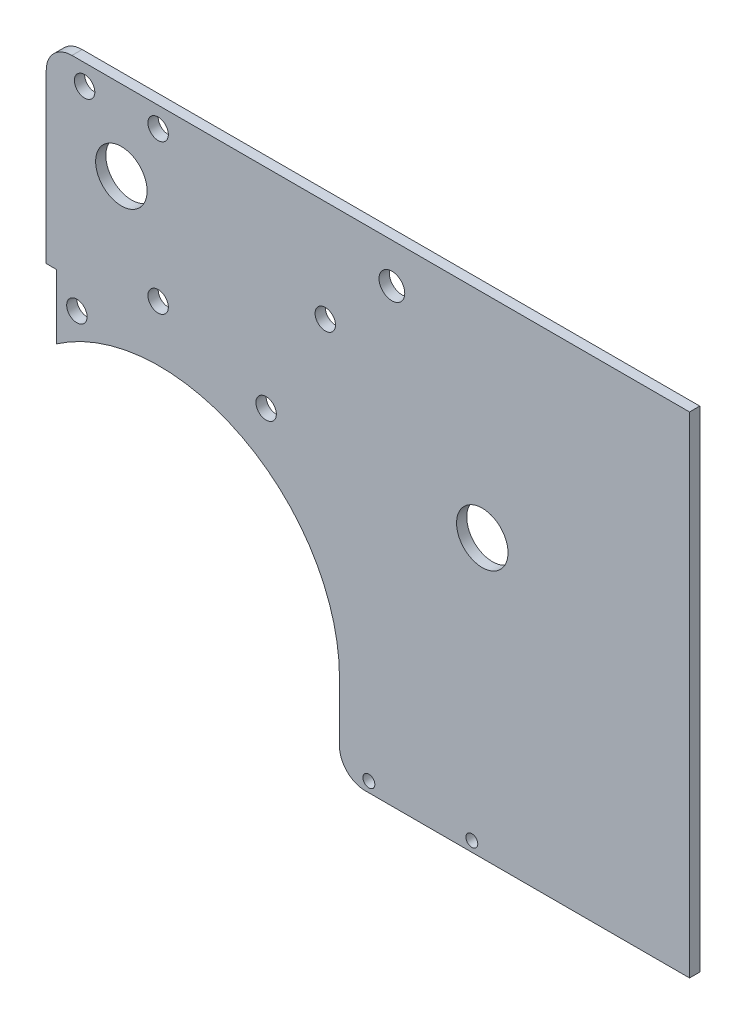
ISO-10303-21;
HEADER;
FILE_DESCRIPTION(('STEP AP214'),'2;1');
FILE_NAME('part.step','',(''),(''),'','','');
FILE_SCHEMA(('AUTOMOTIVE_DESIGN { 1 0 10303 214 1 1 1 1 }'));
ENDSEC;
DATA;
#1=APPLICATION_CONTEXT('core data for automotive mechanical design processes');
#2=APPLICATION_PROTOCOL_DEFINITION('international standard','automotive_design',2000,#1);
#3=PRODUCT_CONTEXT('',#1,'mechanical');
#4=PRODUCT('Part','Part','',(#3));
#5=PRODUCT_RELATED_PRODUCT_CATEGORY('part','',(#4));
#6=PRODUCT_DEFINITION_FORMATION('','',#4);
#7=PRODUCT_DEFINITION_CONTEXT('part definition',#1,'design');
#8=PRODUCT_DEFINITION('design','',#6,#7);
#9=PRODUCT_DEFINITION_SHAPE('','',#8);
#10=(LENGTH_UNIT() NAMED_UNIT(*) SI_UNIT(.MILLI.,.METRE.));
#11=(NAMED_UNIT(*) PLANE_ANGLE_UNIT() SI_UNIT($,.RADIAN.));
#12=(NAMED_UNIT(*) SI_UNIT($,.STERADIAN.) SOLID_ANGLE_UNIT());
#13=UNCERTAINTY_MEASURE_WITH_UNIT(LENGTH_MEASURE(1.E-05),#10,'distance_accuracy_value','');
#14=(GEOMETRIC_REPRESENTATION_CONTEXT(3) GLOBAL_UNCERTAINTY_ASSIGNED_CONTEXT((#13)) GLOBAL_UNIT_ASSIGNED_CONTEXT((#10,
#11,#12)) REPRESENTATION_CONTEXT('',''));
#15=CARTESIAN_POINT('',(0.,0.,0.));
#16=DIRECTION('',(0.,0.,1.));
#17=DIRECTION('',(1.,0.,0.));
#18=AXIS2_PLACEMENT_3D('',#15,#16,#17);
#19=CARTESIAN_POINT('',(176.640929786,-127.55,-3.175));
#20=DIRECTION('',(1.,0.,0.));
#21=DIRECTION('',(0.,0.,-1.));
#22=AXIS2_PLACEMENT_3D('',#19,#20,#21);
#23=PLANE('',#22);
#24=DIRECTION('',(0.,1.,0.));
#25=VECTOR('',#24,1.);
#26=CARTESIAN_POINT('',(176.640929786,-127.55,0.));
#27=LINE('',#26,#25);
#28=CARTESIAN_POINT('',(176.640929786,-127.55,0.));
#29=VERTEX_POINT('',#28);
#30=CARTESIAN_POINT('',(176.640929786,24.85,0.));
#31=VERTEX_POINT('',#30);
#32=EDGE_CURVE('E155',#29,#31,#27,.T.);
#33=ORIENTED_EDGE('',*,*,#32,.F.);
#34=DIRECTION('',(0.,0.,1.));
#35=VECTOR('',#34,1.);
#36=CARTESIAN_POINT('',(176.640929786,-127.55,-3.175));
#37=LINE('',#36,#35);
#38=CARTESIAN_POINT('',(176.640929786,-127.55,-3.175));
#39=VERTEX_POINT('',#38);
#40=EDGE_CURVE('E132',#39,#29,#37,.T.);
#41=ORIENTED_EDGE('',*,*,#40,.F.);
#42=DIRECTION('',(0.,1.,0.));
#43=VECTOR('',#42,1.);
#44=CARTESIAN_POINT('',(176.640929786,-127.55,-3.175));
#45=LINE('',#44,#43);
#46=CARTESIAN_POINT('',(176.640929786,24.85,-3.175));
#47=VERTEX_POINT('',#46);
#48=EDGE_CURVE('E126',#39,#47,#45,.T.);
#49=ORIENTED_EDGE('',*,*,#48,.T.);
#50=DIRECTION('',(0.,0.,1.));
#51=VECTOR('',#50,1.);
#52=CARTESIAN_POINT('',(176.640929786,24.85,-3.175));
#53=LINE('',#52,#51);
#54=EDGE_CURVE('E108',#47,#31,#53,.T.);
#55=ORIENTED_EDGE('',*,*,#54,.T.);
#56=EDGE_LOOP('',(#33,#41,#49,#55));
#57=FACE_BOUND('',#56,.T.);
#58=ADVANCED_FACE('F33',(#57),#23,.T.);
#59=CARTESIAN_POINT('',(176.640929786,-127.55,-3.175));
#60=DIRECTION('',(0.,-1.,0.));
#61=DIRECTION('',(0.,0.,-1.));
#62=AXIS2_PLACEMENT_3D('',#59,#60,#61);
#63=PLANE('',#62);
#64=DIRECTION('',(1.,0.,0.));
#65=VECTOR('',#64,1.);
#66=CARTESIAN_POINT('',(176.640929786,-127.55,0.));
#67=LINE('',#66,#65);
#68=CARTESIAN_POINT('',(75.8159297860001,-127.55,0.));
#69=VERTEX_POINT('',#68);
#70=EDGE_CURVE('E133',#69,#29,#67,.T.);
#71=ORIENTED_EDGE('',*,*,#70,.F.);
#72=DIRECTION('',(0.,0.,1.));
#73=VECTOR('',#72,1.);
#74=CARTESIAN_POINT('',(75.8159297860001,-127.55,-3.175));
#75=LINE('',#74,#73);
#76=CARTESIAN_POINT('',(75.8159297860001,-127.55,-3.175));
#77=VERTEX_POINT('',#76);
#78=EDGE_CURVE('E186',#69,#77,#75,.F.);
#79=ORIENTED_EDGE('',*,*,#78,.T.);
#80=DIRECTION('',(1.,0.,0.));
#81=VECTOR('',#80,1.);
#82=CARTESIAN_POINT('',(176.640929786,-127.55,-3.175));
#83=LINE('',#82,#81);
#84=EDGE_CURVE('E120',#77,#39,#83,.T.);
#85=ORIENTED_EDGE('',*,*,#84,.T.);
#86=ORIENTED_EDGE('',*,*,#40,.T.);
#87=EDGE_LOOP('',(#71,#79,#85,#86));
#88=FACE_BOUND('',#87,.T.);
#89=ADVANCED_FACE('F197',(#88),#63,.T.);
#90=CARTESIAN_POINT('',(67.815929786,-101.2,-3.175));
#91=DIRECTION('',(-1.,0.,0.));
#92=DIRECTION('',(0.,-1.,0.));
#93=AXIS2_PLACEMENT_3D('',#90,#91,#92);
#94=PLANE('',#93);
#95=DIRECTION('',(0.,-1.,0.));
#96=VECTOR('',#95,1.);
#97=CARTESIAN_POINT('',(67.815929786,-101.2,-3.175));
#98=LINE('',#97,#96);
#99=CARTESIAN_POINT('',(67.815929786,-101.2,-3.175));
#100=VERTEX_POINT('',#99);
#101=CARTESIAN_POINT('',(67.8159297860001,-119.55,-3.175));
#102=VERTEX_POINT('',#101);
#103=EDGE_CURVE('E151',#100,#102,#98,.T.);
#104=ORIENTED_EDGE('',*,*,#103,.T.);
#105=DIRECTION('',(0.,0.,1.));
#106=VECTOR('',#105,1.);
#107=CARTESIAN_POINT('',(67.8159297860001,-119.55,-3.175));
#108=LINE('',#107,#106);
#109=CARTESIAN_POINT('',(67.8159297860001,-119.55,0.));
#110=VERTEX_POINT('',#109);
#111=EDGE_CURVE('E173',#102,#110,#108,.T.);
#112=ORIENTED_EDGE('',*,*,#111,.T.);
#113=DIRECTION('',(0.,-1.,0.));
#114=VECTOR('',#113,1.);
#115=CARTESIAN_POINT('',(67.815929786,-101.2,0.));
#116=LINE('',#115,#114);
#117=CARTESIAN_POINT('',(67.815929786,-101.2,0.));
#118=VERTEX_POINT('',#117);
#119=EDGE_CURVE('E135',#118,#110,#116,.T.);
#120=ORIENTED_EDGE('',*,*,#119,.F.);
#121=DIRECTION('',(0.,0.,1.));
#122=VECTOR('',#121,1.);
#123=CARTESIAN_POINT('',(67.815929786,-101.2,-3.175));
#124=LINE('',#123,#122);
#125=EDGE_CURVE('E174',#100,#118,#124,.T.);
#126=ORIENTED_EDGE('',*,*,#125,.F.);
#127=EDGE_LOOP('',(#104,#112,#120,#126));
#128=FACE_BOUND('',#127,.T.);
#129=ADVANCED_FACE('F205',(#128),#94,.T.);
#130=CARTESIAN_POINT('',(11.815929786,-101.2,-3.175));
#131=DIRECTION('',(0.,0.,1.));
#132=DIRECTION('',(1.,0.,0.));
#133=AXIS2_PLACEMENT_3D('',#130,#131,#132);
#134=CYLINDRICAL_SURFACE('',#133,56.);
#135=CARTESIAN_POINT('',(11.815929786,-101.2,0.));
#136=DIRECTION('',(0.,0.,-1.));
#137=DIRECTION('',(1.,0.,0.));
#138=AXIS2_PLACEMENT_3D('',#135,#136,#137);
#139=CIRCLE('',#138,56.);
#140=CARTESIAN_POINT('',(-20.1840702140001,-55.2434988276957,0.));
#141=VERTEX_POINT('',#140);
#142=EDGE_CURVE('E167',#141,#118,#139,.T.);
#143=ORIENTED_EDGE('',*,*,#142,.F.);
#144=DIRECTION('',(0.,0.,1.));
#145=VECTOR('',#144,1.);
#146=CARTESIAN_POINT('',(-20.1840702140001,-55.2434988276957,-3.175));
#147=LINE('',#146,#145);
#148=CARTESIAN_POINT('',(-20.1840702140001,-55.2434988276957,-3.175));
#149=VERTEX_POINT('',#148);
#150=EDGE_CURVE('E176',#149,#141,#147,.T.);
#151=ORIENTED_EDGE('',*,*,#150,.F.);
#152=CARTESIAN_POINT('',(11.815929786,-101.2,-3.175));
#153=DIRECTION('',(0.,0.,-1.));
#154=DIRECTION('',(1.,0.,0.));
#155=AXIS2_PLACEMENT_3D('',#152,#153,#154);
#156=CIRCLE('',#155,56.);
#157=EDGE_CURVE('E148',#149,#100,#156,.T.);
#158=ORIENTED_EDGE('',*,*,#157,.T.);
#159=ORIENTED_EDGE('',*,*,#125,.T.);
#160=EDGE_LOOP('',(#143,#151,#158,#159));
#161=FACE_BOUND('',#160,.T.);
#162=ADVANCED_FACE('F209',(#161),#134,.F.);
#163=CARTESIAN_POINT('',(-20.1840702140001,-55.2434988276957,-3.175));
#164=DIRECTION('',(-1.,0.,0.));
#165=DIRECTION('',(0.,0.,1.));
#166=AXIS2_PLACEMENT_3D('',#163,#164,#165);
#167=PLANE('',#166);
#168=DIRECTION('',(0.,-1.,0.));
#169=VECTOR('',#168,1.);
#170=CARTESIAN_POINT('',(-20.1840702140001,-55.2434988276957,0.));
#171=LINE('',#170,#169);
#172=CARTESIAN_POINT('',(-20.1840702140001,-35.2,0.));
#173=VERTEX_POINT('',#172);
#174=EDGE_CURVE('E164',#173,#141,#171,.T.);
#175=ORIENTED_EDGE('',*,*,#174,.F.);
#176=DIRECTION('',(0.,0.,1.));
#177=VECTOR('',#176,1.);
#178=CARTESIAN_POINT('',(-20.1840702140001,-35.2,-3.175));
#179=LINE('',#178,#177);
#180=CARTESIAN_POINT('',(-20.1840702140001,-35.2,-3.175));
#181=VERTEX_POINT('',#180);
#182=EDGE_CURVE('E178',#181,#173,#179,.T.);
#183=ORIENTED_EDGE('',*,*,#182,.F.);
#184=DIRECTION('',(0.,-1.,0.));
#185=VECTOR('',#184,1.);
#186=CARTESIAN_POINT('',(-20.1840702140001,-55.2434988276957,-3.175));
#187=LINE('',#186,#185);
#188=EDGE_CURVE('E145',#181,#149,#187,.T.);
#189=ORIENTED_EDGE('',*,*,#188,.T.);
#190=ORIENTED_EDGE('',*,*,#150,.T.);
#191=EDGE_LOOP('',(#175,#183,#189,#190));
#192=FACE_BOUND('',#191,.T.);
#193=ADVANCED_FACE('F214',(#192),#167,.T.);
#194=CARTESIAN_POINT('',(-20.1840702140001,-35.2,-3.175));
#195=DIRECTION('',(0.,-1.,0.));
#196=DIRECTION('',(0.,0.,-1.));
#197=AXIS2_PLACEMENT_3D('',#194,#195,#196);
#198=PLANE('',#197);
#199=DIRECTION('',(1.,0.,0.));
#200=VECTOR('',#199,1.);
#201=CARTESIAN_POINT('',(-20.1840702140001,-35.2,0.));
#202=LINE('',#201,#200);
#203=CARTESIAN_POINT('',(-23.3590702140001,-35.2,0.));
#204=VERTEX_POINT('',#203);
#205=EDGE_CURVE('E161',#204,#173,#202,.T.);
#206=ORIENTED_EDGE('',*,*,#205,.F.);
#207=DIRECTION('',(0.,0.,1.));
#208=VECTOR('',#207,1.);
#209=CARTESIAN_POINT('',(-23.3590702140001,-35.2,-3.175));
#210=LINE('',#209,#208);
#211=CARTESIAN_POINT('',(-23.3590702140001,-35.2,-3.175));
#212=VERTEX_POINT('',#211);
#213=EDGE_CURVE('E119',#212,#204,#210,.T.);
#214=ORIENTED_EDGE('',*,*,#213,.F.);
#215=DIRECTION('',(1.,0.,0.));
#216=VECTOR('',#215,1.);
#217=CARTESIAN_POINT('',(-20.1840702140001,-35.2,-3.175));
#218=LINE('',#217,#216);
#219=EDGE_CURVE('E142',#212,#181,#218,.T.);
#220=ORIENTED_EDGE('',*,*,#219,.T.);
#221=ORIENTED_EDGE('',*,*,#182,.T.);
#222=EDGE_LOOP('',(#206,#214,#220,#221));
#223=FACE_BOUND('',#222,.T.);
#224=ADVANCED_FACE('F217',(#223),#198,.T.);
#225=CARTESIAN_POINT('',(-23.3590702140001,-35.2,-3.175));
#226=DIRECTION('',(-1.,0.,0.));
#227=DIRECTION('',(0.,-1.,0.));
#228=AXIS2_PLACEMENT_3D('',#225,#226,#227);
#229=PLANE('',#228);
#230=DIRECTION('',(0.,-1.,0.));
#231=VECTOR('',#230,1.);
#232=CARTESIAN_POINT('',(-23.3590702140001,-35.2,0.));
#233=LINE('',#232,#231);
#234=CARTESIAN_POINT('',(-23.3590702140001,16.85,0.));
#235=VERTEX_POINT('',#234);
#236=EDGE_CURVE('E159',#235,#204,#233,.T.);
#237=ORIENTED_EDGE('',*,*,#236,.F.);
#238=DIRECTION('',(0.,0.,1.));
#239=VECTOR('',#238,1.);
#240=CARTESIAN_POINT('',(-23.3590702140001,16.85,-3.175));
#241=LINE('',#240,#239);
#242=CARTESIAN_POINT('',(-23.3590702140001,16.85,-3.175));
#243=VERTEX_POINT('',#242);
#244=EDGE_CURVE('E41',#235,#243,#241,.F.);
#245=ORIENTED_EDGE('',*,*,#244,.T.);
#246=DIRECTION('',(0.,-1.,0.));
#247=VECTOR('',#246,1.);
#248=CARTESIAN_POINT('',(-23.3590702140001,-35.2,-3.175));
#249=LINE('',#248,#247);
#250=EDGE_CURVE('E128',#243,#212,#249,.T.);
#251=ORIENTED_EDGE('',*,*,#250,.T.);
#252=ORIENTED_EDGE('',*,*,#213,.T.);
#253=EDGE_LOOP('',(#237,#245,#251,#252));
#254=FACE_BOUND('',#253,.T.);
#255=ADVANCED_FACE('F233',(#254),#229,.T.);
#256=CARTESIAN_POINT('',(176.640929786,24.85,-3.175));
#257=DIRECTION('',(0.,1.,0.));
#258=DIRECTION('',(-1.,0.,0.));
#259=AXIS2_PLACEMENT_3D('',#256,#257,#258);
#260=PLANE('',#259);
#261=DIRECTION('',(-1.,0.,0.));
#262=VECTOR('',#261,1.);
#263=CARTESIAN_POINT('',(176.640929786,24.85,-3.175));
#264=LINE('',#263,#262);
#265=CARTESIAN_POINT('',(-15.3590702140001,24.85,-3.175));
#266=VERTEX_POINT('',#265);
#267=EDGE_CURVE('E112',#47,#266,#264,.T.);
#268=ORIENTED_EDGE('',*,*,#267,.T.);
#269=DIRECTION('',(0.,0.,1.));
#270=VECTOR('',#269,1.);
#271=CARTESIAN_POINT('',(-15.3590702140001,24.85,-3.175));
#272=LINE('',#271,#270);
#273=CARTESIAN_POINT('',(-15.3590702140001,24.85,0.));
#274=VERTEX_POINT('',#273);
#275=EDGE_CURVE('E190',#266,#274,#272,.T.);
#276=ORIENTED_EDGE('',*,*,#275,.T.);
#277=DIRECTION('',(-1.,0.,0.));
#278=VECTOR('',#277,1.);
#279=CARTESIAN_POINT('',(176.640929786,24.85,0.));
#280=LINE('',#279,#278);
#281=EDGE_CURVE('E114',#31,#274,#280,.T.);
#282=ORIENTED_EDGE('',*,*,#281,.F.);
#283=ORIENTED_EDGE('',*,*,#54,.F.);
#284=EDGE_LOOP('',(#268,#276,#282,#283));
#285=FACE_BOUND('',#284,.T.);
#286=ADVANCED_FACE('F110',(#285),#260,.T.);
#287=CARTESIAN_POINT('',(11.815929786,-101.2,-3.175));
#288=DIRECTION('',(0.,0.,1.));
#289=DIRECTION('',(1.,0.,0.));
#290=AXIS2_PLACEMENT_3D('',#287,#288,#289);
#291=PLANE('',#290);
#292=CARTESIAN_POINT('',(84.1028283178775,12.5,-3.175));
#293=DIRECTION('',(0.,0.,1.));
#294=DIRECTION('',(1.,0.,0.));
#295=AXIS2_PLACEMENT_3D('',#292,#293,#294);
#296=CIRCLE('',#295,4.00000000000001);
#297=CARTESIAN_POINT('',(88.1028283178775,12.5,-3.175));
#298=VERTEX_POINT('',#297);
#299=EDGE_CURVE('E297',#298,#298,#296,.T.);
#300=ORIENTED_EDGE('',*,*,#299,.T.);
#301=EDGE_LOOP('',(#300));
#302=FACE_BOUND('',#301,.T.);
#303=CARTESIAN_POINT('',(11.43,18.5,-3.175));
#304=DIRECTION('',(0.,0.,1.));
#305=DIRECTION('',(1.,0.,0.));
#306=AXIS2_PLACEMENT_3D('',#303,#304,#305);
#307=CIRCLE('',#306,3.175);
#308=CARTESIAN_POINT('',(14.605,18.5,-3.175));
#309=VERTEX_POINT('',#308);
#310=EDGE_CURVE('E305',#309,#309,#307,.T.);
#311=ORIENTED_EDGE('',*,*,#310,.T.);
#312=EDGE_LOOP('',(#311));
#313=FACE_BOUND('',#312,.T.);
#314=CARTESIAN_POINT('',(-11.43,18.5,-3.175));
#315=DIRECTION('',(0.,0.,1.));
#316=DIRECTION('',(1.,0.,0.));
#317=AXIS2_PLACEMENT_3D('',#314,#315,#316);
#318=CIRCLE('',#317,3.175);
#319=CARTESIAN_POINT('',(-8.25500000000003,18.5,-3.175));
#320=VERTEX_POINT('',#319);
#321=EDGE_CURVE('E311',#320,#320,#318,.T.);
#322=ORIENTED_EDGE('',*,*,#321,.T.);
#323=EDGE_LOOP('',(#322));
#324=FACE_BOUND('',#323,.T.);
#325=CARTESIAN_POINT('',(11.43,-27.9600000000001,-3.175));
#326=DIRECTION('',(0.,0.,1.));
#327=DIRECTION('',(1.,0.,0.));
#328=AXIS2_PLACEMENT_3D('',#325,#326,#327);
#329=CIRCLE('',#328,3.175);
#330=CARTESIAN_POINT('',(14.605,-27.9600000000001,-3.175));
#331=VERTEX_POINT('',#330);
#332=EDGE_CURVE('E317',#331,#331,#329,.T.);
#333=ORIENTED_EDGE('',*,*,#332,.T.);
#334=EDGE_LOOP('',(#333));
#335=FACE_BOUND('',#334,.T.);
#336=CARTESIAN_POINT('',(-13.8340702140001,-43.2,-3.175));
#337=DIRECTION('',(0.,0.,1.));
#338=DIRECTION('',(1.,0.,0.));
#339=AXIS2_PLACEMENT_3D('',#336,#337,#338);
#340=CIRCLE('',#339,3.175);
#341=CARTESIAN_POINT('',(-10.6590702140001,-43.2,-3.175));
#342=VERTEX_POINT('',#341);
#343=EDGE_CURVE('E323',#342,#342,#340,.T.);
#344=ORIENTED_EDGE('',*,*,#343,.T.);
#345=EDGE_LOOP('',(#344));
#346=FACE_BOUND('',#345,.T.);
#347=CARTESIAN_POINT('',(76.95,-124.375,-3.175));
#348=DIRECTION('',(0.,0.,1.));
#349=DIRECTION('',(1.,0.,0.));
#350=AXIS2_PLACEMENT_3D('',#347,#348,#349);
#351=CIRCLE('',#350,1.85000000000001);
#352=CARTESIAN_POINT('',(78.8,-124.375,-3.175));
#353=VERTEX_POINT('',#352);
#354=EDGE_CURVE('E329',#353,#353,#351,.T.);
#355=ORIENTED_EDGE('',*,*,#354,.T.);
#356=EDGE_LOOP('',(#355));
#357=FACE_BOUND('',#356,.T.);
#358=CARTESIAN_POINT('',(108.95,-124.375,-3.175));
#359=DIRECTION('',(0.,0.,1.));
#360=DIRECTION('',(1.,0.,0.));
#361=AXIS2_PLACEMENT_3D('',#358,#359,#360);
#362=CIRCLE('',#361,1.85000000000001);
#363=CARTESIAN_POINT('',(110.8,-124.375,-3.175));
#364=VERTEX_POINT('',#363);
#365=EDGE_CURVE('E335',#364,#364,#362,.T.);
#366=ORIENTED_EDGE('',*,*,#365,.T.);
#367=EDGE_LOOP('',(#366));
#368=FACE_BOUND('',#367,.T.);
#369=CARTESIAN_POINT('',(63.4043935455172,-6.8,-3.175));
#370=DIRECTION('',(0.,0.,1.));
#371=DIRECTION('',(1.,0.,0.));
#372=AXIS2_PLACEMENT_3D('',#369,#370,#371);
#373=CIRCLE('',#372,3.175);
#374=CARTESIAN_POINT('',(66.5793935455172,-6.8,-3.175));
#375=VERTEX_POINT('',#374);
#376=EDGE_CURVE('E341',#375,#375,#373,.T.);
#377=ORIENTED_EDGE('',*,*,#376,.T.);
#378=EDGE_LOOP('',(#377));
#379=FACE_BOUND('',#378,.T.);
#380=CARTESIAN_POINT('',(45.,-40.,-3.175));
#381=DIRECTION('',(0.,0.,1.));
#382=DIRECTION('',(1.,0.,0.));
#383=AXIS2_PLACEMENT_3D('',#380,#381,#382);
#384=CIRCLE('',#383,3.175);
#385=CARTESIAN_POINT('',(48.175,-40.,-3.175));
#386=VERTEX_POINT('',#385);
#387=EDGE_CURVE('E347',#386,#386,#384,.T.);
#388=ORIENTED_EDGE('',*,*,#387,.T.);
#389=EDGE_LOOP('',(#388));
#390=FACE_BOUND('',#389,.T.);
#391=CARTESIAN_POINT('',(0.,-1.66533453693773E-13,-3.175));
#392=DIRECTION('',(0.,0.,1.));
#393=DIRECTION('',(1.,0.,0.));
#394=AXIS2_PLACEMENT_3D('',#391,#392,#393);
#395=CIRCLE('',#394,8.);
#396=CARTESIAN_POINT('',(8.00000000000003,-1.66533453693773E-13,-3.175));
#397=VERTEX_POINT('',#396);
#398=EDGE_CURVE('E353',#397,#397,#395,.T.);
#399=ORIENTED_EDGE('',*,*,#398,.T.);
#400=EDGE_LOOP('',(#399));
#401=FACE_BOUND('',#400,.T.);
#402=CARTESIAN_POINT('',(112.2,-41.2749999999999,-3.175));
#403=DIRECTION('',(0.,0.,1.));
#404=DIRECTION('',(1.,0.,0.));
#405=AXIS2_PLACEMENT_3D('',#402,#403,#404);
#406=CIRCLE('',#405,8.00000000000003);
#407=CARTESIAN_POINT('',(120.2,-41.2749999999999,-3.175));
#408=VERTEX_POINT('',#407);
#409=EDGE_CURVE('E157',#408,#408,#406,.T.);
#410=ORIENTED_EDGE('',*,*,#409,.T.);
#411=EDGE_LOOP('',(#410));
#412=FACE_BOUND('',#411,.T.);
#413=ORIENTED_EDGE('',*,*,#250,.F.);
#414=CARTESIAN_POINT('',(-15.3590702140001,16.85,-3.175));
#415=DIRECTION('',(0.,0.,1.));
#416=DIRECTION('',(1.,0.,0.));
#417=AXIS2_PLACEMENT_3D('',#414,#415,#416);
#418=CIRCLE('',#417,8.);
#419=EDGE_CURVE('E11',#243,#266,#418,.F.);
#420=ORIENTED_EDGE('',*,*,#419,.T.);
#421=ORIENTED_EDGE('',*,*,#267,.F.);
#422=ORIENTED_EDGE('',*,*,#48,.F.);
#423=ORIENTED_EDGE('',*,*,#84,.F.);
#424=CARTESIAN_POINT('',(75.8159297860001,-119.55,-3.175));
#425=DIRECTION('',(0.,0.,1.));
#426=DIRECTION('',(1.,0.,0.));
#427=AXIS2_PLACEMENT_3D('',#424,#425,#426);
#428=CIRCLE('',#427,8.);
#429=EDGE_CURVE('E188',#77,#102,#428,.F.);
#430=ORIENTED_EDGE('',*,*,#429,.T.);
#431=ORIENTED_EDGE('',*,*,#103,.F.);
#432=ORIENTED_EDGE('',*,*,#157,.F.);
#433=ORIENTED_EDGE('',*,*,#188,.F.);
#434=ORIENTED_EDGE('',*,*,#219,.F.);
#435=EDGE_LOOP('',(#413,#420,#421,#422,#423,#430,#431,#432,#433,#434));
#436=FACE_BOUND('',#435,.T.);
#437=ADVANCED_FACE('F124',(#302,#313,#324,#335,#346,#357,#368,#379,#390,#401,#412,#436),#291,.F.);
#438=CARTESIAN_POINT('',(11.815929786,-101.2,0.));
#439=DIRECTION('',(0.,0.,1.));
#440=DIRECTION('',(1.,0.,0.));
#441=AXIS2_PLACEMENT_3D('',#438,#439,#440);
#442=PLANE('',#441);
#443=CARTESIAN_POINT('',(84.1028283178775,12.5,0.));
#444=DIRECTION('',(0.,0.,1.));
#445=DIRECTION('',(1.,0.,0.));
#446=AXIS2_PLACEMENT_3D('',#443,#444,#445);
#447=CIRCLE('',#446,4.00000000000001);
#448=CARTESIAN_POINT('',(88.1028283178775,12.5,0.));
#449=VERTEX_POINT('',#448);
#450=EDGE_CURVE('E300',#449,#449,#447,.T.);
#451=ORIENTED_EDGE('',*,*,#450,.F.);
#452=EDGE_LOOP('',(#451));
#453=FACE_BOUND('',#452,.T.);
#454=CARTESIAN_POINT('',(11.43,18.5,0.));
#455=DIRECTION('',(0.,0.,1.));
#456=DIRECTION('',(1.,0.,0.));
#457=AXIS2_PLACEMENT_3D('',#454,#455,#456);
#458=CIRCLE('',#457,3.175);
#459=CARTESIAN_POINT('',(14.605,18.5,0.));
#460=VERTEX_POINT('',#459);
#461=EDGE_CURVE('E302',#460,#460,#458,.T.);
#462=ORIENTED_EDGE('',*,*,#461,.F.);
#463=EDGE_LOOP('',(#462));
#464=FACE_BOUND('',#463,.T.);
#465=CARTESIAN_POINT('',(-11.43,18.5,0.));
#466=DIRECTION('',(0.,0.,1.));
#467=DIRECTION('',(1.,0.,0.));
#468=AXIS2_PLACEMENT_3D('',#465,#466,#467);
#469=CIRCLE('',#468,3.175);
#470=CARTESIAN_POINT('',(-8.25500000000003,18.5,0.));
#471=VERTEX_POINT('',#470);
#472=EDGE_CURVE('E308',#471,#471,#469,.T.);
#473=ORIENTED_EDGE('',*,*,#472,.F.);
#474=EDGE_LOOP('',(#473));
#475=FACE_BOUND('',#474,.T.);
#476=CARTESIAN_POINT('',(11.43,-27.9600000000001,0.));
#477=DIRECTION('',(0.,0.,1.));
#478=DIRECTION('',(1.,0.,0.));
#479=AXIS2_PLACEMENT_3D('',#476,#477,#478);
#480=CIRCLE('',#479,3.175);
#481=CARTESIAN_POINT('',(14.605,-27.9600000000001,0.));
#482=VERTEX_POINT('',#481);
#483=EDGE_CURVE('E314',#482,#482,#480,.T.);
#484=ORIENTED_EDGE('',*,*,#483,.F.);
#485=EDGE_LOOP('',(#484));
#486=FACE_BOUND('',#485,.T.);
#487=CARTESIAN_POINT('',(-13.8340702140001,-43.2,0.));
#488=DIRECTION('',(0.,0.,1.));
#489=DIRECTION('',(1.,0.,0.));
#490=AXIS2_PLACEMENT_3D('',#487,#488,#489);
#491=CIRCLE('',#490,3.175);
#492=CARTESIAN_POINT('',(-10.6590702140001,-43.2,0.));
#493=VERTEX_POINT('',#492);
#494=EDGE_CURVE('E320',#493,#493,#491,.T.);
#495=ORIENTED_EDGE('',*,*,#494,.F.);
#496=EDGE_LOOP('',(#495));
#497=FACE_BOUND('',#496,.T.);
#498=CARTESIAN_POINT('',(76.95,-124.375,0.));
#499=DIRECTION('',(0.,0.,1.));
#500=DIRECTION('',(1.,0.,0.));
#501=AXIS2_PLACEMENT_3D('',#498,#499,#500);
#502=CIRCLE('',#501,1.85000000000001);
#503=CARTESIAN_POINT('',(78.8,-124.375,0.));
#504=VERTEX_POINT('',#503);
#505=EDGE_CURVE('E326',#504,#504,#502,.T.);
#506=ORIENTED_EDGE('',*,*,#505,.F.);
#507=EDGE_LOOP('',(#506));
#508=FACE_BOUND('',#507,.T.);
#509=CARTESIAN_POINT('',(108.95,-124.375,0.));
#510=DIRECTION('',(0.,0.,1.));
#511=DIRECTION('',(1.,0.,0.));
#512=AXIS2_PLACEMENT_3D('',#509,#510,#511);
#513=CIRCLE('',#512,1.85000000000001);
#514=CARTESIAN_POINT('',(110.8,-124.375,0.));
#515=VERTEX_POINT('',#514);
#516=EDGE_CURVE('E332',#515,#515,#513,.T.);
#517=ORIENTED_EDGE('',*,*,#516,.F.);
#518=EDGE_LOOP('',(#517));
#519=FACE_BOUND('',#518,.T.);
#520=CARTESIAN_POINT('',(63.4043935455172,-6.8,0.));
#521=DIRECTION('',(0.,0.,1.));
#522=DIRECTION('',(1.,0.,0.));
#523=AXIS2_PLACEMENT_3D('',#520,#521,#522);
#524=CIRCLE('',#523,3.175);
#525=CARTESIAN_POINT('',(66.5793935455172,-6.8,0.));
#526=VERTEX_POINT('',#525);
#527=EDGE_CURVE('E338',#526,#526,#524,.T.);
#528=ORIENTED_EDGE('',*,*,#527,.F.);
#529=EDGE_LOOP('',(#528));
#530=FACE_BOUND('',#529,.T.);
#531=CARTESIAN_POINT('',(45.,-40.,0.));
#532=DIRECTION('',(0.,0.,1.));
#533=DIRECTION('',(1.,0.,0.));
#534=AXIS2_PLACEMENT_3D('',#531,#532,#533);
#535=CIRCLE('',#534,3.175);
#536=CARTESIAN_POINT('',(48.175,-40.,0.));
#537=VERTEX_POINT('',#536);
#538=EDGE_CURVE('E344',#537,#537,#535,.T.);
#539=ORIENTED_EDGE('',*,*,#538,.F.);
#540=EDGE_LOOP('',(#539));
#541=FACE_BOUND('',#540,.T.);
#542=CARTESIAN_POINT('',(0.,-1.66533453693773E-13,0.));
#543=DIRECTION('',(0.,0.,1.));
#544=DIRECTION('',(1.,0.,0.));
#545=AXIS2_PLACEMENT_3D('',#542,#543,#544);
#546=CIRCLE('',#545,8.);
#547=CARTESIAN_POINT('',(8.00000000000003,-1.66533453693773E-13,0.));
#548=VERTEX_POINT('',#547);
#549=EDGE_CURVE('E350',#548,#548,#546,.T.);
#550=ORIENTED_EDGE('',*,*,#549,.F.);
#551=EDGE_LOOP('',(#550));
#552=FACE_BOUND('',#551,.T.);
#553=CARTESIAN_POINT('',(112.2,-41.2749999999999,0.));
#554=DIRECTION('',(0.,0.,1.));
#555=DIRECTION('',(1.,0.,0.));
#556=AXIS2_PLACEMENT_3D('',#553,#554,#555);
#557=CIRCLE('',#556,8.00000000000003);
#558=CARTESIAN_POINT('',(120.2,-41.2749999999999,0.));
#559=VERTEX_POINT('',#558);
#560=EDGE_CURVE('E138',#559,#559,#557,.T.);
#561=ORIENTED_EDGE('',*,*,#560,.F.);
#562=EDGE_LOOP('',(#561));
#563=FACE_BOUND('',#562,.T.);
#564=ORIENTED_EDGE('',*,*,#281,.T.);
#565=CARTESIAN_POINT('',(-15.3590702140001,16.85,0.));
#566=DIRECTION('',(0.,0.,1.));
#567=DIRECTION('',(1.,0.,0.));
#568=AXIS2_PLACEMENT_3D('',#565,#566,#567);
#569=CIRCLE('',#568,8.);
#570=EDGE_CURVE('E55',#274,#235,#569,.T.);
#571=ORIENTED_EDGE('',*,*,#570,.T.);
#572=ORIENTED_EDGE('',*,*,#236,.T.);
#573=ORIENTED_EDGE('',*,*,#205,.T.);
#574=ORIENTED_EDGE('',*,*,#174,.T.);
#575=ORIENTED_EDGE('',*,*,#142,.T.);
#576=ORIENTED_EDGE('',*,*,#119,.T.);
#577=CARTESIAN_POINT('',(75.8159297860001,-119.55,0.));
#578=DIRECTION('',(0.,0.,1.));
#579=DIRECTION('',(1.,0.,0.));
#580=AXIS2_PLACEMENT_3D('',#577,#578,#579);
#581=CIRCLE('',#580,8.);
#582=EDGE_CURVE('E184',#110,#69,#581,.T.);
#583=ORIENTED_EDGE('',*,*,#582,.T.);
#584=ORIENTED_EDGE('',*,*,#70,.T.);
#585=ORIENTED_EDGE('',*,*,#32,.T.);
#586=EDGE_LOOP('',(#564,#571,#572,#573,#574,#575,#576,#583,#584,#585));
#587=FACE_BOUND('',#586,.T.);
#588=ADVANCED_FACE('F193',(#453,#464,#475,#486,#497,#508,#519,#530,#541,#552,#563,#587),#442,.T.);
#589=CARTESIAN_POINT('',(112.2,-41.2749999999999,-3.175));
#590=DIRECTION('',(0.,0.,1.));
#591=DIRECTION('',(1.,0.,0.));
#592=AXIS2_PLACEMENT_3D('',#589,#590,#591);
#593=CYLINDRICAL_SURFACE('',#592,8.00000000000003);
#594=ORIENTED_EDGE('',*,*,#409,.F.);
#595=EDGE_LOOP('',(#594));
#596=FACE_BOUND('',#595,.T.);
#597=ORIENTED_EDGE('',*,*,#560,.T.);
#598=EDGE_LOOP('',(#597));
#599=FACE_BOUND('',#598,.T.);
#600=ADVANCED_FACE('F246',(#596,#599),#593,.F.);
#601=CARTESIAN_POINT('',(0.,-1.66533453693773E-13,-3.175));
#602=DIRECTION('',(0.,0.,1.));
#603=DIRECTION('',(1.,0.,0.));
#604=AXIS2_PLACEMENT_3D('',#601,#602,#603);
#605=CYLINDRICAL_SURFACE('',#604,8.);
#606=ORIENTED_EDGE('',*,*,#398,.F.);
#607=EDGE_LOOP('',(#606));
#608=FACE_BOUND('',#607,.T.);
#609=ORIENTED_EDGE('',*,*,#549,.T.);
#610=EDGE_LOOP('',(#609));
#611=FACE_BOUND('',#610,.T.);
#612=ADVANCED_FACE('F253',(#608,#611),#605,.F.);
#613=CARTESIAN_POINT('',(45.,-40.,-3.175));
#614=DIRECTION('',(0.,0.,1.));
#615=DIRECTION('',(1.,0.,0.));
#616=AXIS2_PLACEMENT_3D('',#613,#614,#615);
#617=CYLINDRICAL_SURFACE('',#616,3.175);
#618=ORIENTED_EDGE('',*,*,#387,.F.);
#619=EDGE_LOOP('',(#618));
#620=FACE_BOUND('',#619,.T.);
#621=ORIENTED_EDGE('',*,*,#538,.T.);
#622=EDGE_LOOP('',(#621));
#623=FACE_BOUND('',#622,.T.);
#624=ADVANCED_FACE('F257',(#620,#623),#617,.F.);
#625=CARTESIAN_POINT('',(63.4043935455172,-6.8,-3.175));
#626=DIRECTION('',(0.,0.,1.));
#627=DIRECTION('',(1.,0.,0.));
#628=AXIS2_PLACEMENT_3D('',#625,#626,#627);
#629=CYLINDRICAL_SURFACE('',#628,3.175);
#630=ORIENTED_EDGE('',*,*,#376,.F.);
#631=EDGE_LOOP('',(#630));
#632=FACE_BOUND('',#631,.T.);
#633=ORIENTED_EDGE('',*,*,#527,.T.);
#634=EDGE_LOOP('',(#633));
#635=FACE_BOUND('',#634,.T.);
#636=ADVANCED_FACE('F261',(#632,#635),#629,.F.);
#637=CARTESIAN_POINT('',(108.95,-124.375,-3.175));
#638=DIRECTION('',(0.,0.,1.));
#639=DIRECTION('',(1.,0.,0.));
#640=AXIS2_PLACEMENT_3D('',#637,#638,#639);
#641=CYLINDRICAL_SURFACE('',#640,1.85000000000001);
#642=ORIENTED_EDGE('',*,*,#365,.F.);
#643=EDGE_LOOP('',(#642));
#644=FACE_BOUND('',#643,.T.);
#645=ORIENTED_EDGE('',*,*,#516,.T.);
#646=EDGE_LOOP('',(#645));
#647=FACE_BOUND('',#646,.T.);
#648=ADVANCED_FACE('F265',(#644,#647),#641,.F.);
#649=CARTESIAN_POINT('',(76.95,-124.375,-3.175));
#650=DIRECTION('',(0.,0.,1.));
#651=DIRECTION('',(1.,0.,0.));
#652=AXIS2_PLACEMENT_3D('',#649,#650,#651);
#653=CYLINDRICAL_SURFACE('',#652,1.85000000000001);
#654=ORIENTED_EDGE('',*,*,#354,.F.);
#655=EDGE_LOOP('',(#654));
#656=FACE_BOUND('',#655,.T.);
#657=ORIENTED_EDGE('',*,*,#505,.T.);
#658=EDGE_LOOP('',(#657));
#659=FACE_BOUND('',#658,.T.);
#660=ADVANCED_FACE('F269',(#656,#659),#653,.F.);
#661=CARTESIAN_POINT('',(-13.8340702140001,-43.2,-3.175));
#662=DIRECTION('',(0.,0.,1.));
#663=DIRECTION('',(1.,0.,0.));
#664=AXIS2_PLACEMENT_3D('',#661,#662,#663);
#665=CYLINDRICAL_SURFACE('',#664,3.175);
#666=ORIENTED_EDGE('',*,*,#343,.F.);
#667=EDGE_LOOP('',(#666));
#668=FACE_BOUND('',#667,.T.);
#669=ORIENTED_EDGE('',*,*,#494,.T.);
#670=EDGE_LOOP('',(#669));
#671=FACE_BOUND('',#670,.T.);
#672=ADVANCED_FACE('F273',(#668,#671),#665,.F.);
#673=CARTESIAN_POINT('',(11.43,-27.9600000000001,-3.175));
#674=DIRECTION('',(0.,0.,1.));
#675=DIRECTION('',(1.,0.,0.));
#676=AXIS2_PLACEMENT_3D('',#673,#674,#675);
#677=CYLINDRICAL_SURFACE('',#676,3.175);
#678=ORIENTED_EDGE('',*,*,#332,.F.);
#679=EDGE_LOOP('',(#678));
#680=FACE_BOUND('',#679,.T.);
#681=ORIENTED_EDGE('',*,*,#483,.T.);
#682=EDGE_LOOP('',(#681));
#683=FACE_BOUND('',#682,.T.);
#684=ADVANCED_FACE('F277',(#680,#683),#677,.F.);
#685=CARTESIAN_POINT('',(-11.43,18.5,-3.175));
#686=DIRECTION('',(0.,0.,1.));
#687=DIRECTION('',(1.,0.,0.));
#688=AXIS2_PLACEMENT_3D('',#685,#686,#687);
#689=CYLINDRICAL_SURFACE('',#688,3.175);
#690=ORIENTED_EDGE('',*,*,#321,.F.);
#691=EDGE_LOOP('',(#690));
#692=FACE_BOUND('',#691,.T.);
#693=ORIENTED_EDGE('',*,*,#472,.T.);
#694=EDGE_LOOP('',(#693));
#695=FACE_BOUND('',#694,.T.);
#696=ADVANCED_FACE('F281',(#692,#695),#689,.F.);
#697=CARTESIAN_POINT('',(11.43,18.5,-3.175));
#698=DIRECTION('',(0.,0.,1.));
#699=DIRECTION('',(1.,0.,0.));
#700=AXIS2_PLACEMENT_3D('',#697,#698,#699);
#701=CYLINDRICAL_SURFACE('',#700,3.175);
#702=ORIENTED_EDGE('',*,*,#310,.F.);
#703=EDGE_LOOP('',(#702));
#704=FACE_BOUND('',#703,.T.);
#705=ORIENTED_EDGE('',*,*,#461,.T.);
#706=EDGE_LOOP('',(#705));
#707=FACE_BOUND('',#706,.T.);
#708=ADVANCED_FACE('F285',(#704,#707),#701,.F.);
#709=CARTESIAN_POINT('',(84.1028283178775,12.5,-3.175));
#710=DIRECTION('',(0.,0.,1.));
#711=DIRECTION('',(1.,0.,0.));
#712=AXIS2_PLACEMENT_3D('',#709,#710,#711);
#713=CYLINDRICAL_SURFACE('',#712,4.00000000000001);
#714=ORIENTED_EDGE('',*,*,#299,.F.);
#715=EDGE_LOOP('',(#714));
#716=FACE_BOUND('',#715,.T.);
#717=ORIENTED_EDGE('',*,*,#450,.T.);
#718=EDGE_LOOP('',(#717));
#719=FACE_BOUND('',#718,.T.);
#720=ADVANCED_FACE('F223',(#716,#719),#713,.F.);
#721=CARTESIAN_POINT('',(75.8159297860001,-119.55,-3.175));
#722=DIRECTION('',(0.,0.,1.));
#723=DIRECTION('',(1.,0.,0.));
#724=AXIS2_PLACEMENT_3D('',#721,#722,#723);
#725=CYLINDRICAL_SURFACE('',#724,8.);
#726=ORIENTED_EDGE('',*,*,#429,.F.);
#727=ORIENTED_EDGE('',*,*,#78,.F.);
#728=ORIENTED_EDGE('',*,*,#582,.F.);
#729=ORIENTED_EDGE('',*,*,#111,.F.);
#730=EDGE_LOOP('',(#726,#727,#728,#729));
#731=FACE_BOUND('',#730,.T.);
#732=ADVANCED_FACE('F202',(#731),#725,.T.);
#733=CARTESIAN_POINT('',(-15.3590702140001,16.85,-3.175));
#734=DIRECTION('',(0.,0.,1.));
#735=DIRECTION('',(1.,0.,0.));
#736=AXIS2_PLACEMENT_3D('',#733,#734,#735);
#737=CYLINDRICAL_SURFACE('',#736,8.);
#738=ORIENTED_EDGE('',*,*,#419,.F.);
#739=ORIENTED_EDGE('',*,*,#244,.F.);
#740=ORIENTED_EDGE('',*,*,#570,.F.);
#741=ORIENTED_EDGE('',*,*,#275,.F.);
#742=EDGE_LOOP('',(#738,#739,#740,#741));
#743=FACE_BOUND('',#742,.T.);
#744=ADVANCED_FACE('F35',(#743),#737,.T.);
#745=CLOSED_SHELL('',(#58,#89,#129,#162,#193,#224,#255,#286,#437,#588,#600,#612,#624,#636,#648,
#660,#672,#684,#696,#708,#720,#732,#744));
#746=MANIFOLD_SOLID_BREP('B2',#745);
#747=ADVANCED_BREP_SHAPE_REPRESENTATION('',(#18,#746),#14);
#748=SHAPE_DEFINITION_REPRESENTATION(#9,#747);
ENDSEC;
END-ISO-10303-21;
